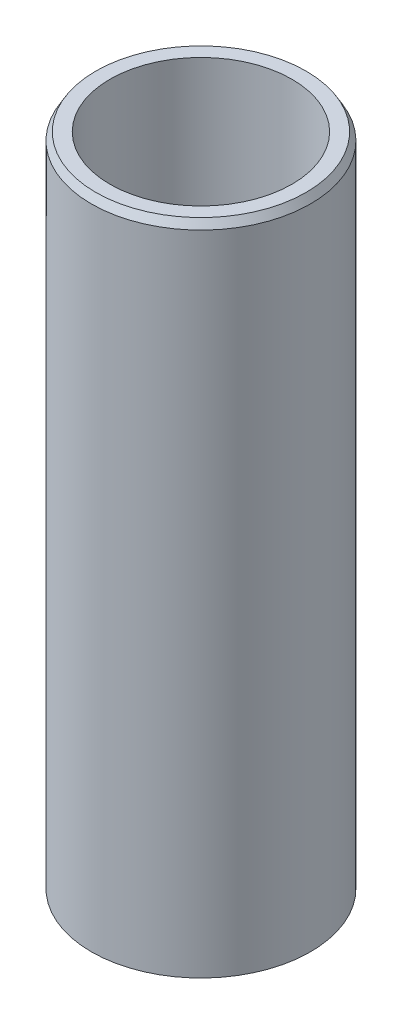
ISO-10303-21;
HEADER;
FILE_DESCRIPTION(('STEP AP214'),'2;1');
FILE_NAME('part.step','',(''),(''),'','','');
FILE_SCHEMA(('AUTOMOTIVE_DESIGN { 1 0 10303 214 1 1 1 1 }'));
ENDSEC;
DATA;
#1=APPLICATION_CONTEXT('core data for automotive mechanical design processes');
#2=APPLICATION_PROTOCOL_DEFINITION('international standard','automotive_design',2000,#1);
#3=PRODUCT_CONTEXT('',#1,'mechanical');
#4=PRODUCT('Part','Part','',(#3));
#5=PRODUCT_RELATED_PRODUCT_CATEGORY('part','',(#4));
#6=PRODUCT_DEFINITION_FORMATION('','',#4);
#7=PRODUCT_DEFINITION_CONTEXT('part definition',#1,'design');
#8=PRODUCT_DEFINITION('design','',#6,#7);
#9=PRODUCT_DEFINITION_SHAPE('','',#8);
#10=(LENGTH_UNIT() NAMED_UNIT(*) SI_UNIT(.MILLI.,.METRE.));
#11=(NAMED_UNIT(*) PLANE_ANGLE_UNIT() SI_UNIT($,.RADIAN.));
#12=(NAMED_UNIT(*) SI_UNIT($,.STERADIAN.) SOLID_ANGLE_UNIT());
#13=UNCERTAINTY_MEASURE_WITH_UNIT(LENGTH_MEASURE(1.E-05),#10,'distance_accuracy_value','');
#14=(GEOMETRIC_REPRESENTATION_CONTEXT(3) GLOBAL_UNCERTAINTY_ASSIGNED_CONTEXT((#13)) GLOBAL_UNIT_ASSIGNED_CONTEXT((#10,
#11,#12)) REPRESENTATION_CONTEXT('',''));
#15=CARTESIAN_POINT('',(0.,0.,0.));
#16=DIRECTION('',(0.,0.,1.));
#17=DIRECTION('',(1.,0.,0.));
#18=AXIS2_PLACEMENT_3D('',#15,#16,#17);
#19=CARTESIAN_POINT('',(0.,346.202775524343,0.));
#20=DIRECTION('',(0.,-1.,0.));
#21=DIRECTION('',(0.,0.,-1.));
#22=AXIS2_PLACEMENT_3D('',#19,#20,#21);
#23=CYLINDRICAL_SURFACE('',#22,57.5);
#24=CARTESIAN_POINT('',(0.,342.153067413582,0.));
#25=DIRECTION('',(0.,1.,0.));
#26=DIRECTION('',(0.,0.,1.));
#27=AXIS2_PLACEMENT_3D('',#24,#25,#26);
#28=CIRCLE('',#27,57.5);
#29=CARTESIAN_POINT('',(0.,342.153067413582,57.5));
#30=VERTEX_POINT('',#29);
#31=EDGE_CURVE('E50',#30,#30,#28,.F.);
#32=ORIENTED_EDGE('',*,*,#31,.T.);
#33=EDGE_LOOP('',(#32));
#34=FACE_BOUND('',#33,.T.);
#35=CARTESIAN_POINT('',(0.,2.33810006788676,0.));
#36=DIRECTION('',(0.,1.,0.));
#37=DIRECTION('',(0.,0.,1.));
#38=AXIS2_PLACEMENT_3D('',#35,#36,#37);
#39=CIRCLE('',#38,57.5);
#40=CARTESIAN_POINT('',(0.,2.33810006788676,57.5));
#41=VERTEX_POINT('',#40);
#42=EDGE_CURVE('E51',#41,#41,#39,.T.);
#43=ORIENTED_EDGE('',*,*,#42,.T.);
#44=EDGE_LOOP('',(#43));
#45=FACE_BOUND('',#44,.T.);
#46=ADVANCED_FACE('F39',(#34,#45),#23,.T.);
#47=CARTESIAN_POINT('',(0.,346.202775524343,0.));
#48=DIRECTION('',(0.,1.,0.));
#49=DIRECTION('',(0.,0.,1.));
#50=AXIS2_PLACEMENT_3D('',#47,#48,#49);
#51=PLANE('',#50);
#52=CARTESIAN_POINT('',(0.,346.202775524343,0.));
#53=DIRECTION('',(0.,1.,0.));
#54=DIRECTION('',(0.,0.,1.));
#55=AXIS2_PLACEMENT_3D('',#52,#53,#54);
#56=CIRCLE('',#55,55.1618999321133);
#57=CARTESIAN_POINT('',(0.,346.202775524343,55.1618999321133));
#58=VERTEX_POINT('',#57);
#59=EDGE_CURVE('E54',#58,#58,#56,.T.);
#60=ORIENTED_EDGE('',*,*,#59,.T.);
#61=EDGE_LOOP('',(#60));
#62=FACE_BOUND('',#61,.T.);
#63=CARTESIAN_POINT('',(0.,346.202775524343,0.));
#64=DIRECTION('',(0.,1.,0.));
#65=DIRECTION('',(0.,0.,1.));
#66=AXIS2_PLACEMENT_3D('',#63,#64,#65);
#67=CIRCLE('',#66,47.7497080015065);
#68=CARTESIAN_POINT('',(0.,346.202775524343,47.7497080015065));
#69=VERTEX_POINT('',#68);
#70=EDGE_CURVE('E58',#69,#69,#67,.T.);
#71=ORIENTED_EDGE('',*,*,#70,.F.);
#72=EDGE_LOOP('',(#71));
#73=FACE_BOUND('',#72,.T.);
#74=ADVANCED_FACE('F69',(#62,#73),#51,.T.);
#75=CARTESIAN_POINT('',(0.,0.,0.));
#76=DIRECTION('',(0.,1.,0.));
#77=DIRECTION('',(0.,0.,1.));
#78=AXIS2_PLACEMENT_3D('',#75,#76,#77);
#79=PLANE('',#78);
#80=CARTESIAN_POINT('',(0.,0.,0.));
#81=DIRECTION('',(0.,1.,0.));
#82=DIRECTION('',(0.,0.,1.));
#83=AXIS2_PLACEMENT_3D('',#80,#81,#82);
#84=CIRCLE('',#83,53.4502918892399);
#85=CARTESIAN_POINT('',(0.,0.,53.4502918892399));
#86=VERTEX_POINT('',#85);
#87=EDGE_CURVE('E10',#86,#86,#84,.F.);
#88=ORIENTED_EDGE('',*,*,#87,.T.);
#89=EDGE_LOOP('',(#88));
#90=FACE_BOUND('',#89,.T.);
#91=CARTESIAN_POINT('',(0.,0.,0.));
#92=DIRECTION('',(0.,1.,0.));
#93=DIRECTION('',(0.,0.,1.));
#94=AXIS2_PLACEMENT_3D('',#91,#92,#93);
#95=CIRCLE('',#94,47.7497080015065);
#96=CARTESIAN_POINT('',(0.,0.,47.7497080015065));
#97=VERTEX_POINT('',#96);
#98=EDGE_CURVE('E63',#97,#97,#95,.T.);
#99=ORIENTED_EDGE('',*,*,#98,.T.);
#100=EDGE_LOOP('',(#99));
#101=FACE_BOUND('',#100,.T.);
#102=ADVANCED_FACE('F75',(#90,#101),#79,.F.);
#103=CARTESIAN_POINT('',(0.,346.202775524343,0.));
#104=DIRECTION('',(0.,-1.,0.));
#105=DIRECTION('',(0.,0.,-1.));
#106=AXIS2_PLACEMENT_3D('',#103,#104,#105);
#107=CYLINDRICAL_SURFACE('',#106,47.7497080015065);
#108=ORIENTED_EDGE('',*,*,#70,.T.);
#109=EDGE_LOOP('',(#108));
#110=FACE_BOUND('',#109,.T.);
#111=ORIENTED_EDGE('',*,*,#98,.F.);
#112=EDGE_LOOP('',(#111));
#113=FACE_BOUND('',#112,.T.);
#114=ADVANCED_FACE('F70',(#110,#113),#107,.F.);
#115=CARTESIAN_POINT('',(0.,346.202775524343,0.));
#116=DIRECTION('',(0.,-1.,0.));
#117=DIRECTION('',(0.,0.,-1.));
#118=AXIS2_PLACEMENT_3D('',#115,#116,#117);
#119=CONICAL_SURFACE('',#118,55.1618999321133,0.523598775598295);
#120=ORIENTED_EDGE('',*,*,#31,.F.);
#121=EDGE_LOOP('',(#120));
#122=FACE_BOUND('',#121,.T.);
#123=ORIENTED_EDGE('',*,*,#59,.F.);
#124=EDGE_LOOP('',(#123));
#125=FACE_BOUND('',#124,.T.);
#126=ADVANCED_FACE('F81',(#122,#125),#119,.T.);
#127=CARTESIAN_POINT('',(0.,2.33810006788676,0.));
#128=DIRECTION('',(0.,1.,0.));
#129=DIRECTION('',(0.,0.,1.));
#130=AXIS2_PLACEMENT_3D('',#127,#128,#129);
#131=CONICAL_SURFACE('',#130,57.5,1.0471975511966);
#132=ORIENTED_EDGE('',*,*,#87,.F.);
#133=EDGE_LOOP('',(#132));
#134=FACE_BOUND('',#133,.T.);
#135=ORIENTED_EDGE('',*,*,#42,.F.);
#136=EDGE_LOOP('',(#135));
#137=FACE_BOUND('',#136,.T.);
#138=ADVANCED_FACE('F45',(#134,#137),#131,.T.);
#139=CLOSED_SHELL('',(#46,#74,#102,#114,#126,#138));
#140=MANIFOLD_SOLID_BREP('B2',#139);
#141=ADVANCED_BREP_SHAPE_REPRESENTATION('',(#18,#140),#14);
#142=SHAPE_DEFINITION_REPRESENTATION(#9,#141);
ENDSEC;
END-ISO-10303-21;
